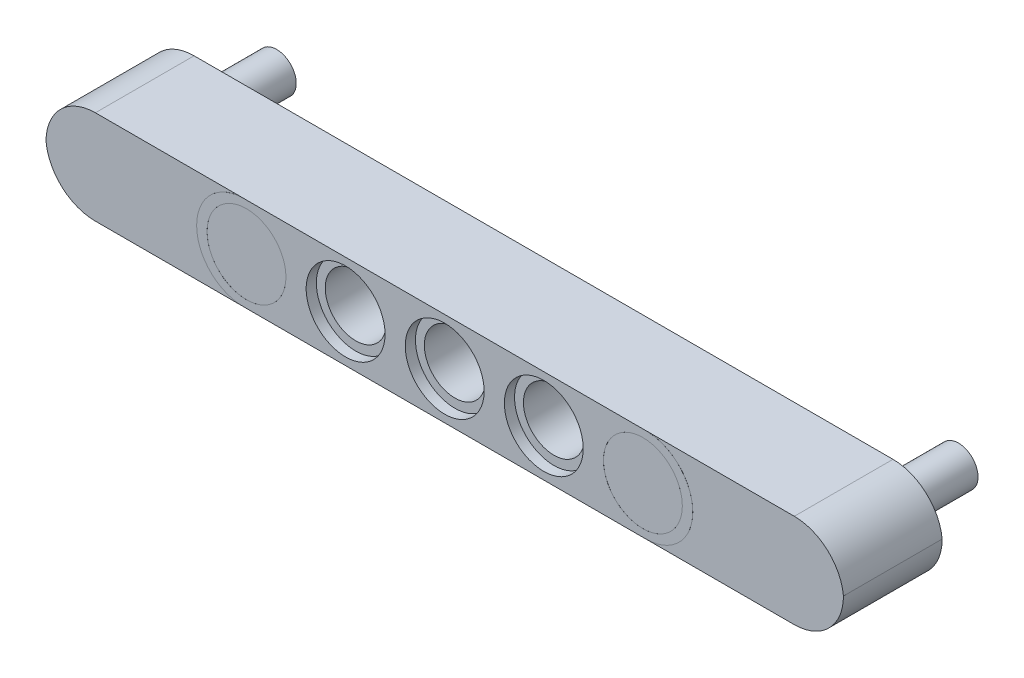
ISO-10303-21;
HEADER;
FILE_DESCRIPTION(('STEP AP214'),'2;1');
FILE_NAME('part.step','',(''),(''),'','','');
FILE_SCHEMA(('AUTOMOTIVE_DESIGN { 1 0 10303 214 1 1 1 1 }'));
ENDSEC;
DATA;
#1=APPLICATION_CONTEXT('core data for automotive mechanical design processes');
#2=APPLICATION_PROTOCOL_DEFINITION('international standard','automotive_design',2000,#1);
#3=PRODUCT_CONTEXT('',#1,'mechanical');
#4=PRODUCT('Part','Part','',(#3));
#5=PRODUCT_RELATED_PRODUCT_CATEGORY('part','',(#4));
#6=PRODUCT_DEFINITION_FORMATION('','',#4);
#7=PRODUCT_DEFINITION_CONTEXT('part definition',#1,'design');
#8=PRODUCT_DEFINITION('design','',#6,#7);
#9=PRODUCT_DEFINITION_SHAPE('','',#8);
#10=(LENGTH_UNIT() NAMED_UNIT(*) SI_UNIT(.MILLI.,.METRE.));
#11=(NAMED_UNIT(*) PLANE_ANGLE_UNIT() SI_UNIT($,.RADIAN.));
#12=(NAMED_UNIT(*) SI_UNIT($,.STERADIAN.) SOLID_ANGLE_UNIT());
#13=UNCERTAINTY_MEASURE_WITH_UNIT(LENGTH_MEASURE(1.E-05),#10,'distance_accuracy_value','');
#14=(GEOMETRIC_REPRESENTATION_CONTEXT(3) GLOBAL_UNCERTAINTY_ASSIGNED_CONTEXT((#13)) GLOBAL_UNIT_ASSIGNED_CONTEXT((#10,
#11,#12)) REPRESENTATION_CONTEXT('',''));
#15=CARTESIAN_POINT('',(0.,0.,0.));
#16=DIRECTION('',(0.,0.,1.));
#17=DIRECTION('',(1.,0.,0.));
#18=AXIS2_PLACEMENT_3D('',#15,#16,#17);
#19=CARTESIAN_POINT('',(35.7843,3.69,7.8764));
#20=DIRECTION('',(0.,0.,1.));
#21=DIRECTION('',(1.,0.,0.));
#22=AXIS2_PLACEMENT_3D('',#19,#20,#21);
#23=CYLINDRICAL_SURFACE('',#22,3.8007);
#24=DIRECTION('',(0.,0.,1.));
#25=VECTOR('',#24,1.);
#26=CARTESIAN_POINT('',(35.7843,-0.1107,7.8764));
#27=LINE('',#26,#25);
#28=CARTESIAN_POINT('',(35.7843,-0.110699999999999,7.8736));
#29=VERTEX_POINT('',#28);
#30=CARTESIAN_POINT('',(35.7843,-0.1107,7.8764));
#31=VERTEX_POINT('',#30);
#32=EDGE_CURVE('E161',#29,#31,#27,.T.);
#33=ORIENTED_EDGE('',*,*,#32,.F.);
#34=CARTESIAN_POINT('',(35.7843,3.69,7.8736));
#35=DIRECTION('',(0.,0.,-1.));
#36=DIRECTION('',(-1.,0.,0.));
#37=AXIS2_PLACEMENT_3D('',#34,#35,#36);
#38=CIRCLE('',#37,3.8007);
#39=CARTESIAN_POINT('',(39.585,3.69,7.8736));
#40=VERTEX_POINT('',#39);
#41=EDGE_CURVE('E227',#29,#40,#38,.F.);
#42=ORIENTED_EDGE('',*,*,#41,.T.);
#43=DIRECTION('',(0.,0.,1.));
#44=VECTOR('',#43,1.);
#45=CARTESIAN_POINT('',(39.585,3.69,7.8764));
#46=LINE('',#45,#44);
#47=CARTESIAN_POINT('',(39.585,3.69,7.8764));
#48=VERTEX_POINT('',#47);
#49=EDGE_CURVE('E149',#40,#48,#46,.T.);
#50=ORIENTED_EDGE('',*,*,#49,.T.);
#51=CARTESIAN_POINT('',(35.7843,3.69,7.8764));
#52=DIRECTION('',(0.,0.,-1.));
#53=DIRECTION('',(-1.,0.,0.));
#54=AXIS2_PLACEMENT_3D('',#51,#52,#53);
#55=CIRCLE('',#54,3.8007);
#56=EDGE_CURVE('E163',#31,#48,#55,.F.);
#57=ORIENTED_EDGE('',*,*,#56,.F.);
#58=EDGE_LOOP('',(#33,#42,#50,#57));
#59=FACE_BOUND('',#58,.T.);
#60=ADVANCED_FACE('F39',(#59),#23,.T.);
#61=CARTESIAN_POINT('',(35.7843,3.69,7.8764));
#62=DIRECTION('',(0.,0.,1.));
#63=DIRECTION('',(1.,0.,0.));
#64=AXIS2_PLACEMENT_3D('',#61,#62,#63);
#65=CYLINDRICAL_SURFACE('',#64,3.8007);
#66=ORIENTED_EDGE('',*,*,#49,.F.);
#67=CARTESIAN_POINT('',(35.7843,3.69,7.8736));
#68=DIRECTION('',(0.,0.,-1.));
#69=DIRECTION('',(-1.,0.,0.));
#70=AXIS2_PLACEMENT_3D('',#67,#68,#69);
#71=CIRCLE('',#70,3.8007);
#72=CARTESIAN_POINT('',(35.7843,7.4907,7.8736));
#73=VERTEX_POINT('',#72);
#74=EDGE_CURVE('E166',#40,#73,#71,.F.);
#75=ORIENTED_EDGE('',*,*,#74,.T.);
#76=DIRECTION('',(0.,0.,1.));
#77=VECTOR('',#76,1.);
#78=CARTESIAN_POINT('',(35.7843,7.4907,7.8764));
#79=LINE('',#78,#77);
#80=CARTESIAN_POINT('',(35.7843,7.4907,7.8764));
#81=VERTEX_POINT('',#80);
#82=EDGE_CURVE('E156',#81,#73,#79,.F.);
#83=ORIENTED_EDGE('',*,*,#82,.F.);
#84=CARTESIAN_POINT('',(35.7843,3.69,7.8764));
#85=DIRECTION('',(0.,0.,-1.));
#86=DIRECTION('',(-1.,0.,0.));
#87=AXIS2_PLACEMENT_3D('',#84,#85,#86);
#88=CIRCLE('',#87,3.8007);
#89=EDGE_CURVE('E159',#48,#81,#88,.F.);
#90=ORIENTED_EDGE('',*,*,#89,.F.);
#91=EDGE_LOOP('',(#66,#75,#83,#90));
#92=FACE_BOUND('',#91,.T.);
#93=ADVANCED_FACE('F359',(#92),#65,.T.);
#94=CARTESIAN_POINT('',(3.4526,3.69,7.8764));
#95=DIRECTION('',(0.,0.,-1.));
#96=DIRECTION('',(-1.,0.,0.));
#97=AXIS2_PLACEMENT_3D('',#94,#95,#96);
#98=CYLINDRICAL_SURFACE('',#97,3.193);
#99=CARTESIAN_POINT('',(3.4526,3.69,7.8764));
#100=DIRECTION('',(0.,0.,1.));
#101=DIRECTION('',(1.,0.,0.));
#102=AXIS2_PLACEMENT_3D('',#99,#100,#101);
#103=CIRCLE('',#102,3.193);
#104=CARTESIAN_POINT('',(6.6456,3.69,7.8764));
#105=VERTEX_POINT('',#104);
#106=EDGE_CURVE('E279',#105,#105,#103,.T.);
#107=ORIENTED_EDGE('',*,*,#106,.T.);
#108=EDGE_LOOP('',(#107));
#109=FACE_BOUND('',#108,.T.);
#110=CARTESIAN_POINT('',(3.4526,3.69,7.8736));
#111=DIRECTION('',(0.,0.,-1.));
#112=DIRECTION('',(-1.,0.,0.));
#113=AXIS2_PLACEMENT_3D('',#110,#111,#112);
#114=CIRCLE('',#113,3.193);
#115=CARTESIAN_POINT('',(0.259599999999998,3.69,7.8736));
#116=VERTEX_POINT('',#115);
#117=EDGE_CURVE('E230',#116,#116,#114,.T.);
#118=ORIENTED_EDGE('',*,*,#117,.T.);
#119=EDGE_LOOP('',(#118));
#120=FACE_BOUND('',#119,.T.);
#121=ADVANCED_FACE('F366',(#109,#120),#98,.F.);
#122=CARTESIAN_POINT('',(35.5474,3.69,7.8764));
#123=DIRECTION('',(0.,0.,-1.));
#124=DIRECTION('',(-1.,0.,0.));
#125=AXIS2_PLACEMENT_3D('',#122,#123,#124);
#126=CYLINDRICAL_SURFACE('',#125,3.193);
#127=CARTESIAN_POINT('',(35.5474,3.69,7.8764));
#128=DIRECTION('',(0.,0.,1.));
#129=DIRECTION('',(1.,0.,0.));
#130=AXIS2_PLACEMENT_3D('',#127,#128,#129);
#131=CIRCLE('',#130,3.193);
#132=CARTESIAN_POINT('',(38.7404,3.69,7.8764));
#133=VERTEX_POINT('',#132);
#134=EDGE_CURVE('E300',#133,#133,#131,.T.);
#135=ORIENTED_EDGE('',*,*,#134,.T.);
#136=EDGE_LOOP('',(#135));
#137=FACE_BOUND('',#136,.T.);
#138=CARTESIAN_POINT('',(35.5474,3.69,7.8736));
#139=DIRECTION('',(0.,0.,-1.));
#140=DIRECTION('',(-1.,0.,0.));
#141=AXIS2_PLACEMENT_3D('',#138,#139,#140);
#142=CIRCLE('',#141,3.193);
#143=CARTESIAN_POINT('',(32.3544,3.69,7.8736));
#144=VERTEX_POINT('',#143);
#145=EDGE_CURVE('E236',#144,#144,#142,.T.);
#146=ORIENTED_EDGE('',*,*,#145,.T.);
#147=EDGE_LOOP('',(#146));
#148=FACE_BOUND('',#147,.T.);
#149=ADVANCED_FACE('F502',(#137,#148),#126,.F.);
#150=CARTESIAN_POINT('',(3.2157,3.69,7.8764));
#151=DIRECTION('',(0.,0.,-1.));
#152=DIRECTION('',(-1.,0.,0.));
#153=AXIS2_PLACEMENT_3D('',#150,#151,#152);
#154=CYLINDRICAL_SURFACE('',#153,3.8007);
#155=CARTESIAN_POINT('',(3.2157,3.69,7.8736));
#156=DIRECTION('',(0.,0.,1.));
#157=DIRECTION('',(1.,0.,0.));
#158=AXIS2_PLACEMENT_3D('',#155,#156,#157);
#159=CIRCLE('',#158,3.8007);
#160=CARTESIAN_POINT('',(3.21569999999996,-0.1107,7.8736));
#161=VERTEX_POINT('',#160);
#162=CARTESIAN_POINT('',(-0.584999999999999,3.69,7.8736));
#163=VERTEX_POINT('',#162);
#164=EDGE_CURVE('E127',#161,#163,#159,.F.);
#165=ORIENTED_EDGE('',*,*,#164,.F.);
#166=DIRECTION('',(0.,0.,-1.));
#167=VECTOR('',#166,1.);
#168=CARTESIAN_POINT('',(3.2157,-0.1107,7.8764));
#169=LINE('',#168,#167);
#170=CARTESIAN_POINT('',(3.2157,-0.1107,7.8764));
#171=VERTEX_POINT('',#170);
#172=EDGE_CURVE('E137',#171,#161,#169,.T.);
#173=ORIENTED_EDGE('',*,*,#172,.F.);
#174=CARTESIAN_POINT('',(3.2157,3.69,7.8764));
#175=DIRECTION('',(0.,0.,-1.));
#176=DIRECTION('',(-1.,0.,0.));
#177=AXIS2_PLACEMENT_3D('',#174,#175,#176);
#178=CIRCLE('',#177,3.8007);
#179=CARTESIAN_POINT('',(-0.584999999999999,3.69,7.8764));
#180=VERTEX_POINT('',#179);
#181=EDGE_CURVE('E146',#180,#171,#178,.F.);
#182=ORIENTED_EDGE('',*,*,#181,.F.);
#183=DIRECTION('',(0.,0.,1.));
#184=VECTOR('',#183,1.);
#185=CARTESIAN_POINT('',(-0.584999999999999,3.69,7.8764));
#186=LINE('',#185,#184);
#187=EDGE_CURVE('E140',#180,#163,#186,.F.);
#188=ORIENTED_EDGE('',*,*,#187,.T.);
#189=EDGE_LOOP('',(#165,#173,#182,#188));
#190=FACE_BOUND('',#189,.T.);
#191=ADVANCED_FACE('F136',(#190),#154,.T.);
#192=CARTESIAN_POINT('',(3.2157,3.69,7.8764));
#193=DIRECTION('',(0.,0.,1.));
#194=DIRECTION('',(1.,0.,0.));
#195=AXIS2_PLACEMENT_3D('',#192,#193,#194);
#196=CYLINDRICAL_SURFACE('',#195,3.8007);
#197=CARTESIAN_POINT('',(3.2157,3.69,7.8736));
#198=DIRECTION('',(0.,0.,1.));
#199=DIRECTION('',(1.,0.,0.));
#200=AXIS2_PLACEMENT_3D('',#197,#198,#199);
#201=CIRCLE('',#200,3.8007);
#202=CARTESIAN_POINT('',(3.2157,7.4907,7.8736));
#203=VERTEX_POINT('',#202);
#204=EDGE_CURVE('E169',#163,#203,#201,.F.);
#205=ORIENTED_EDGE('',*,*,#204,.F.);
#206=ORIENTED_EDGE('',*,*,#187,.F.);
#207=CARTESIAN_POINT('',(3.2157,3.69,7.8764));
#208=DIRECTION('',(0.,0.,-1.));
#209=DIRECTION('',(-1.,0.,0.));
#210=AXIS2_PLACEMENT_3D('',#207,#208,#209);
#211=CIRCLE('',#210,3.8007);
#212=CARTESIAN_POINT('',(3.2157,7.4907,7.8764));
#213=VERTEX_POINT('',#212);
#214=EDGE_CURVE('E147',#213,#180,#211,.F.);
#215=ORIENTED_EDGE('',*,*,#214,.F.);
#216=DIRECTION('',(0.,0.,1.));
#217=VECTOR('',#216,1.);
#218=CARTESIAN_POINT('',(3.2157,7.4907,7.8764));
#219=LINE('',#218,#217);
#220=EDGE_CURVE('E303',#203,#213,#219,.T.);
#221=ORIENTED_EDGE('',*,*,#220,.F.);
#222=EDGE_LOOP('',(#205,#206,#215,#221));
#223=FACE_BOUND('',#222,.T.);
#224=ADVANCED_FACE('F315',(#223),#196,.T.);
#225=CARTESIAN_POINT('',(27.5237,3.69,-0.1164));
#226=DIRECTION('',(0.,0.,1.));
#227=DIRECTION('',(1.,0.,0.));
#228=AXIS2_PLACEMENT_3D('',#225,#226,#227);
#229=CYLINDRICAL_SURFACE('',#228,3.193);
#230=CARTESIAN_POINT('',(27.5237,3.69,-0.1164));
#231=DIRECTION('',(0.,0.,1.));
#232=DIRECTION('',(1.,0.,0.));
#233=AXIS2_PLACEMENT_3D('',#230,#231,#232);
#234=CIRCLE('',#233,3.193);
#235=CARTESIAN_POINT('',(30.7167,3.69,-0.1164));
#236=VERTEX_POINT('',#235);
#237=EDGE_CURVE('E297',#236,#236,#234,.T.);
#238=ORIENTED_EDGE('',*,*,#237,.F.);
#239=EDGE_LOOP('',(#238));
#240=FACE_BOUND('',#239,.T.);
#241=CARTESIAN_POINT('',(27.5237,3.69,0.7076));
#242=DIRECTION('',(0.,0.,1.));
#243=DIRECTION('',(1.,0.,0.));
#244=AXIS2_PLACEMENT_3D('',#241,#242,#243);
#245=CIRCLE('',#244,3.193);
#246=CARTESIAN_POINT('',(30.7167,3.69,0.7076));
#247=VERTEX_POINT('',#246);
#248=EDGE_CURVE('E294',#247,#247,#245,.T.);
#249=ORIENTED_EDGE('',*,*,#248,.T.);
#250=EDGE_LOOP('',(#249));
#251=FACE_BOUND('',#250,.T.);
#252=ADVANCED_FACE('F493',(#240,#251),#229,.F.);
#253=CARTESIAN_POINT('',(7.4387,-0.1107,0.7076));
#254=DIRECTION('',(0.,0.,1.));
#255=DIRECTION('',(1.,0.,0.));
#256=AXIS2_PLACEMENT_3D('',#253,#254,#255);
#257=PLANE('',#256);
#258=ORIENTED_EDGE('',*,*,#248,.F.);
#259=EDGE_LOOP('',(#258));
#260=FACE_BOUND('',#259,.T.);
#261=CARTESIAN_POINT('',(27.5237,3.69,0.7076));
#262=DIRECTION('',(0.,0.,1.));
#263=DIRECTION('',(1.,0.,0.));
#264=AXIS2_PLACEMENT_3D('',#261,#262,#263);
#265=CIRCLE('',#264,2.472);
#266=CARTESIAN_POINT('',(29.9957,3.69,0.7076));
#267=VERTEX_POINT('',#266);
#268=EDGE_CURVE('E285',#267,#267,#265,.F.);
#269=ORIENTED_EDGE('',*,*,#268,.F.);
#270=EDGE_LOOP('',(#269));
#271=FACE_BOUND('',#270,.T.);
#272=ADVANCED_FACE('F667',(#260,#271),#257,.F.);
#273=CARTESIAN_POINT('',(7.4387,-0.1107,7.05239999999999));
#274=DIRECTION('',(0.,0.,-1.));
#275=DIRECTION('',(-1.,0.,0.));
#276=AXIS2_PLACEMENT_3D('',#273,#274,#275);
#277=PLANE('',#276);
#278=CARTESIAN_POINT('',(27.5237,3.69,7.0524));
#279=DIRECTION('',(0.,0.,1.));
#280=DIRECTION('',(1.,0.,0.));
#281=AXIS2_PLACEMENT_3D('',#278,#279,#280);
#282=CIRCLE('',#281,3.193);
#283=CARTESIAN_POINT('',(30.7167,3.69,7.0524));
#284=VERTEX_POINT('',#283);
#285=EDGE_CURVE('E291',#284,#284,#282,.T.);
#286=ORIENTED_EDGE('',*,*,#285,.T.);
#287=EDGE_LOOP('',(#286));
#288=FACE_BOUND('',#287,.T.);
#289=CARTESIAN_POINT('',(27.5237,3.69,7.05239999999999));
#290=DIRECTION('',(0.,0.,-1.));
#291=DIRECTION('',(-1.,0.,0.));
#292=AXIS2_PLACEMENT_3D('',#289,#290,#291);
#293=CIRCLE('',#292,2.472);
#294=CARTESIAN_POINT('',(25.0517,3.69,7.05239999999999));
#295=VERTEX_POINT('',#294);
#296=EDGE_CURVE('E282',#295,#295,#293,.F.);
#297=ORIENTED_EDGE('',*,*,#296,.F.);
#298=EDGE_LOOP('',(#297));
#299=FACE_BOUND('',#298,.T.);
#300=ADVANCED_FACE('F663',(#288,#299),#277,.F.);
#301=CARTESIAN_POINT('',(27.5237,3.69,7.8764));
#302=DIRECTION('',(0.,0.,-1.));
#303=DIRECTION('',(-1.,0.,0.));
#304=AXIS2_PLACEMENT_3D('',#301,#302,#303);
#305=CYLINDRICAL_SURFACE('',#304,3.193);
#306=CARTESIAN_POINT('',(27.5237,3.69,7.8764));
#307=DIRECTION('',(0.,0.,1.));
#308=DIRECTION('',(1.,0.,0.));
#309=AXIS2_PLACEMENT_3D('',#306,#307,#308);
#310=CIRCLE('',#309,3.193);
#311=CARTESIAN_POINT('',(30.7167,3.69,7.8764));
#312=VERTEX_POINT('',#311);
#313=EDGE_CURVE('E288',#312,#312,#310,.T.);
#314=ORIENTED_EDGE('',*,*,#313,.T.);
#315=EDGE_LOOP('',(#314));
#316=FACE_BOUND('',#315,.T.);
#317=ORIENTED_EDGE('',*,*,#285,.F.);
#318=EDGE_LOOP('',(#317));
#319=FACE_BOUND('',#318,.T.);
#320=ADVANCED_FACE('F659',(#316,#319),#305,.F.);
#321=CARTESIAN_POINT('',(27.5237,3.69,-0.1164));
#322=DIRECTION('',(0.,0.,1.));
#323=DIRECTION('',(1.,0.,0.));
#324=AXIS2_PLACEMENT_3D('',#321,#322,#323);
#325=CYLINDRICAL_SURFACE('',#324,2.472);
#326=ORIENTED_EDGE('',*,*,#296,.T.);
#327=EDGE_LOOP('',(#326));
#328=FACE_BOUND('',#327,.T.);
#329=ORIENTED_EDGE('',*,*,#268,.T.);
#330=EDGE_LOOP('',(#329));
#331=FACE_BOUND('',#330,.T.);
#332=ADVANCED_FACE('F610',(#328,#331),#325,.F.);
#333=CARTESIAN_POINT('',(11.4763,3.69,7.8764));
#334=DIRECTION('',(0.,0.,-1.));
#335=DIRECTION('',(-1.,0.,0.));
#336=AXIS2_PLACEMENT_3D('',#333,#334,#335);
#337=CYLINDRICAL_SURFACE('',#336,3.193);
#338=CARTESIAN_POINT('',(11.4763,3.69,7.8764));
#339=DIRECTION('',(0.,0.,1.));
#340=DIRECTION('',(1.,0.,0.));
#341=AXIS2_PLACEMENT_3D('',#338,#339,#340);
#342=CIRCLE('',#341,3.193);
#343=CARTESIAN_POINT('',(14.6693,3.69,7.8764));
#344=VERTEX_POINT('',#343);
#345=EDGE_CURVE('E276',#344,#344,#342,.T.);
#346=ORIENTED_EDGE('',*,*,#345,.T.);
#347=EDGE_LOOP('',(#346));
#348=FACE_BOUND('',#347,.T.);
#349=CARTESIAN_POINT('',(11.4763,3.69,7.0524));
#350=DIRECTION('',(0.,0.,1.));
#351=DIRECTION('',(1.,0.,0.));
#352=AXIS2_PLACEMENT_3D('',#349,#350,#351);
#353=CIRCLE('',#352,3.193);
#354=CARTESIAN_POINT('',(14.6693,3.69,7.0524));
#355=VERTEX_POINT('',#354);
#356=EDGE_CURVE('E267',#355,#355,#353,.T.);
#357=ORIENTED_EDGE('',*,*,#356,.F.);
#358=EDGE_LOOP('',(#357));
#359=FACE_BOUND('',#358,.T.);
#360=ADVANCED_FACE('F603',(#348,#359),#337,.F.);
#361=CARTESIAN_POINT('',(-8.6087,-0.1107,0.7076));
#362=DIRECTION('',(0.,0.,1.));
#363=DIRECTION('',(1.,0.,0.));
#364=AXIS2_PLACEMENT_3D('',#361,#362,#363);
#365=PLANE('',#364);
#366=CARTESIAN_POINT('',(11.4763,3.69,0.7076));
#367=DIRECTION('',(0.,0.,1.));
#368=DIRECTION('',(1.,0.,0.));
#369=AXIS2_PLACEMENT_3D('',#366,#367,#368);
#370=CIRCLE('',#369,3.193);
#371=CARTESIAN_POINT('',(14.6693,3.69,0.7076));
#372=VERTEX_POINT('',#371);
#373=EDGE_CURVE('E273',#372,#372,#370,.T.);
#374=ORIENTED_EDGE('',*,*,#373,.F.);
#375=EDGE_LOOP('',(#374));
#376=FACE_BOUND('',#375,.T.);
#377=CARTESIAN_POINT('',(11.4763,3.69,0.7076));
#378=DIRECTION('',(0.,0.,1.));
#379=DIRECTION('',(1.,0.,0.));
#380=AXIS2_PLACEMENT_3D('',#377,#378,#379);
#381=CIRCLE('',#380,2.472);
#382=CARTESIAN_POINT('',(13.9483,3.69,0.7076));
#383=VERTEX_POINT('',#382);
#384=EDGE_CURVE('E264',#383,#383,#381,.F.);
#385=ORIENTED_EDGE('',*,*,#384,.F.);
#386=EDGE_LOOP('',(#385));
#387=FACE_BOUND('',#386,.T.);
#388=ADVANCED_FACE('F609',(#376,#387),#365,.F.);
#389=CARTESIAN_POINT('',(11.4763,3.69,-0.1164));
#390=DIRECTION('',(0.,0.,1.));
#391=DIRECTION('',(1.,0.,0.));
#392=AXIS2_PLACEMENT_3D('',#389,#390,#391);
#393=CYLINDRICAL_SURFACE('',#392,3.193);
#394=CARTESIAN_POINT('',(11.4763,3.69,-0.1164));
#395=DIRECTION('',(0.,0.,1.));
#396=DIRECTION('',(1.,0.,0.));
#397=AXIS2_PLACEMENT_3D('',#394,#395,#396);
#398=CIRCLE('',#397,3.193);
#399=CARTESIAN_POINT('',(14.6693,3.69,-0.1164));
#400=VERTEX_POINT('',#399);
#401=EDGE_CURVE('E270',#400,#400,#398,.T.);
#402=ORIENTED_EDGE('',*,*,#401,.F.);
#403=EDGE_LOOP('',(#402));
#404=FACE_BOUND('',#403,.T.);
#405=ORIENTED_EDGE('',*,*,#373,.T.);
#406=EDGE_LOOP('',(#405));
#407=FACE_BOUND('',#406,.T.);
#408=ADVANCED_FACE('F622',(#404,#407),#393,.F.);
#409=CARTESIAN_POINT('',(-8.6087,-0.1107,7.05239999999999));
#410=DIRECTION('',(0.,0.,-1.));
#411=DIRECTION('',(-1.,0.,0.));
#412=AXIS2_PLACEMENT_3D('',#409,#410,#411);
#413=PLANE('',#412);
#414=ORIENTED_EDGE('',*,*,#356,.T.);
#415=EDGE_LOOP('',(#414));
#416=FACE_BOUND('',#415,.T.);
#417=CARTESIAN_POINT('',(11.4763,3.69,7.05239999999999));
#418=DIRECTION('',(0.,0.,-1.));
#419=DIRECTION('',(-1.,0.,0.));
#420=AXIS2_PLACEMENT_3D('',#417,#418,#419);
#421=CIRCLE('',#420,2.472);
#422=CARTESIAN_POINT('',(9.0043,3.69,7.05239999999999));
#423=VERTEX_POINT('',#422);
#424=EDGE_CURVE('E255',#423,#423,#421,.F.);
#425=ORIENTED_EDGE('',*,*,#424,.F.);
#426=EDGE_LOOP('',(#425));
#427=FACE_BOUND('',#426,.T.);
#428=ADVANCED_FACE('F632',(#416,#427),#413,.F.);
#429=CARTESIAN_POINT('',(11.4763,3.69,-0.1164));
#430=DIRECTION('',(0.,0.,1.));
#431=DIRECTION('',(1.,0.,0.));
#432=AXIS2_PLACEMENT_3D('',#429,#430,#431);
#433=CYLINDRICAL_SURFACE('',#432,2.472);
#434=ORIENTED_EDGE('',*,*,#424,.T.);
#435=EDGE_LOOP('',(#434));
#436=FACE_BOUND('',#435,.T.);
#437=ORIENTED_EDGE('',*,*,#384,.T.);
#438=EDGE_LOOP('',(#437));
#439=FACE_BOUND('',#438,.T.);
#440=ADVANCED_FACE('F414',(#436,#439),#433,.F.);
#441=CARTESIAN_POINT('',(-0.584999999999999,-0.1107,7.8764));
#442=DIRECTION('',(0.,1.,0.));
#443=DIRECTION('',(0.,0.,1.));
#444=AXIS2_PLACEMENT_3D('',#441,#442,#443);
#445=PLANE('',#444);
#446=DIRECTION('',(-1.,0.,0.));
#447=VECTOR('',#446,1.);
#448=CARTESIAN_POINT('',(3.21569999999996,-0.1107,7.8736));
#449=LINE('',#448,#447);
#450=CARTESIAN_POINT('',(-8.80420979499208,-0.1107,7.8736));
#451=VERTEX_POINT('',#450);
#452=EDGE_CURVE('E123',#161,#451,#449,.T.);
#453=ORIENTED_EDGE('',*,*,#452,.T.);
#454=DIRECTION('',(0.,0.,-1.));
#455=VECTOR('',#454,1.);
#456=CARTESIAN_POINT('',(-8.80420979499208,-0.1107,7.8764));
#457=LINE('',#456,#455);
#458=CARTESIAN_POINT('',(-8.80420979499208,-0.1107,-0.116400000000001));
#459=VERTEX_POINT('',#458);
#460=EDGE_CURVE('E196',#451,#459,#457,.T.);
#461=ORIENTED_EDGE('',*,*,#460,.T.);
#462=DIRECTION('',(1.,0.,0.));
#463=VECTOR('',#462,1.);
#464=CARTESIAN_POINT('',(-0.584999999999999,-0.1107,-0.1164));
#465=LINE('',#464,#463);
#466=CARTESIAN_POINT('',(47.7843,-0.1107,-0.1164));
#467=VERTEX_POINT('',#466);
#468=EDGE_CURVE('E204',#459,#467,#465,.T.);
#469=ORIENTED_EDGE('',*,*,#468,.T.);
#470=DIRECTION('',(0.,0.,-1.));
#471=VECTOR('',#470,1.);
#472=CARTESIAN_POINT('',(47.7843,-0.1107,7.8736));
#473=LINE('',#472,#471);
#474=CARTESIAN_POINT('',(47.7843,-0.110700000000001,7.8736));
#475=VERTEX_POINT('',#474);
#476=EDGE_CURVE('E177',#467,#475,#473,.F.);
#477=ORIENTED_EDGE('',*,*,#476,.T.);
#478=DIRECTION('',(-1.,0.,0.));
#479=VECTOR('',#478,1.);
#480=CARTESIAN_POINT('',(35.7843,-0.110699999999999,7.8736));
#481=LINE('',#480,#479);
#482=EDGE_CURVE('E225',#475,#29,#481,.T.);
#483=ORIENTED_EDGE('',*,*,#482,.T.);
#484=ORIENTED_EDGE('',*,*,#32,.T.);
#485=DIRECTION('',(1.,0.,0.));
#486=VECTOR('',#485,1.);
#487=CARTESIAN_POINT('',(-0.584999999999999,-0.1107,7.8764));
#488=LINE('',#487,#486);
#489=EDGE_CURVE('E145',#171,#31,#488,.T.);
#490=ORIENTED_EDGE('',*,*,#489,.F.);
#491=ORIENTED_EDGE('',*,*,#172,.T.);
#492=EDGE_LOOP('',(#453,#461,#469,#477,#483,#484,#490,#491));
#493=FACE_BOUND('',#492,.T.);
#494=ADVANCED_FACE('F143',(#493),#445,.F.);
#495=CARTESIAN_POINT('',(-0.584999999999999,7.4907,7.8764));
#496=DIRECTION('',(0.,-1.,0.));
#497=DIRECTION('',(0.,0.,-1.));
#498=AXIS2_PLACEMENT_3D('',#495,#496,#497);
#499=PLANE('',#498);
#500=DIRECTION('',(-1.,0.,0.));
#501=VECTOR('',#500,1.);
#502=CARTESIAN_POINT('',(-0.584999999999999,7.4907,-0.1164));
#503=LINE('',#502,#501);
#504=CARTESIAN_POINT('',(47.8042097949921,7.4907,-0.116400000000001));
#505=VERTEX_POINT('',#504);
#506=CARTESIAN_POINT('',(-8.7843,7.4907,-0.1164));
#507=VERTEX_POINT('',#506);
#508=EDGE_CURVE('E212',#505,#507,#503,.T.);
#509=ORIENTED_EDGE('',*,*,#508,.T.);
#510=DIRECTION('',(0.,0.,-1.));
#511=VECTOR('',#510,1.);
#512=CARTESIAN_POINT('',(-8.7843,7.4907,7.8736));
#513=LINE('',#512,#511);
#514=CARTESIAN_POINT('',(-8.7843,7.4907,7.8736));
#515=VERTEX_POINT('',#514);
#516=EDGE_CURVE('E192',#507,#515,#513,.F.);
#517=ORIENTED_EDGE('',*,*,#516,.T.);
#518=DIRECTION('',(1.,0.,0.));
#519=VECTOR('',#518,1.);
#520=CARTESIAN_POINT('',(3.21569999999996,7.4907,7.8736));
#521=LINE('',#520,#519);
#522=EDGE_CURVE('E131',#515,#203,#521,.T.);
#523=ORIENTED_EDGE('',*,*,#522,.T.);
#524=ORIENTED_EDGE('',*,*,#220,.T.);
#525=DIRECTION('',(-1.,0.,0.));
#526=VECTOR('',#525,1.);
#527=CARTESIAN_POINT('',(-0.584999999999999,7.4907,7.8764));
#528=LINE('',#527,#526);
#529=EDGE_CURVE('E253',#81,#213,#528,.T.);
#530=ORIENTED_EDGE('',*,*,#529,.F.);
#531=ORIENTED_EDGE('',*,*,#82,.T.);
#532=DIRECTION('',(1.,0.,0.));
#533=VECTOR('',#532,1.);
#534=CARTESIAN_POINT('',(35.7843,7.4907,7.8736));
#535=LINE('',#534,#533);
#536=CARTESIAN_POINT('',(47.8042097949921,7.4907,7.8736));
#537=VERTEX_POINT('',#536);
#538=EDGE_CURVE('E141',#73,#537,#535,.T.);
#539=ORIENTED_EDGE('',*,*,#538,.T.);
#540=DIRECTION('',(0.,0.,-1.));
#541=VECTOR('',#540,1.);
#542=CARTESIAN_POINT('',(47.8042097949921,7.4907,7.8764));
#543=LINE('',#542,#541);
#544=EDGE_CURVE('E181',#537,#505,#543,.T.);
#545=ORIENTED_EDGE('',*,*,#544,.T.);
#546=EDGE_LOOP('',(#509,#517,#523,#524,#530,#531,#539,#545));
#547=FACE_BOUND('',#546,.T.);
#548=ADVANCED_FACE('F307',(#547),#499,.F.);
#549=CARTESIAN_POINT('',(-0.584999999999999,-0.1107,7.8764));
#550=DIRECTION('',(0.,0.,-1.));
#551=DIRECTION('',(-1.,0.,0.));
#552=AXIS2_PLACEMENT_3D('',#549,#550,#551);
#553=PLANE('',#552);
#554=ORIENTED_EDGE('',*,*,#134,.F.);
#555=EDGE_LOOP('',(#554));
#556=FACE_BOUND('',#555,.T.);
#557=ORIENTED_EDGE('',*,*,#313,.F.);
#558=EDGE_LOOP('',(#557));
#559=FACE_BOUND('',#558,.T.);
#560=ORIENTED_EDGE('',*,*,#106,.F.);
#561=EDGE_LOOP('',(#560));
#562=FACE_BOUND('',#561,.T.);
#563=ORIENTED_EDGE('',*,*,#345,.F.);
#564=EDGE_LOOP('',(#563));
#565=FACE_BOUND('',#564,.T.);
#566=CARTESIAN_POINT('',(19.5,3.69,7.8764));
#567=DIRECTION('',(0.,0.,1.));
#568=DIRECTION('',(1.,0.,0.));
#569=AXIS2_PLACEMENT_3D('',#566,#567,#568);
#570=CIRCLE('',#569,3.193);
#571=CARTESIAN_POINT('',(22.693,3.69,7.8764));
#572=VERTEX_POINT('',#571);
#573=EDGE_CURVE('E239',#572,#572,#570,.T.);
#574=ORIENTED_EDGE('',*,*,#573,.F.);
#575=EDGE_LOOP('',(#574));
#576=FACE_BOUND('',#575,.T.);
#577=ORIENTED_EDGE('',*,*,#489,.T.);
#578=ORIENTED_EDGE('',*,*,#56,.T.);
#579=ORIENTED_EDGE('',*,*,#89,.T.);
#580=ORIENTED_EDGE('',*,*,#529,.T.);
#581=ORIENTED_EDGE('',*,*,#214,.T.);
#582=ORIENTED_EDGE('',*,*,#181,.T.);
#583=EDGE_LOOP('',(#577,#578,#579,#580,#581,#582));
#584=FACE_BOUND('',#583,.T.);
#585=ADVANCED_FACE('F312',(#556,#559,#562,#565,#576,#584),#553,.F.);
#586=CARTESIAN_POINT('',(-0.584999999999999,-0.1107,-0.1164));
#587=DIRECTION('',(0.,0.,-1.));
#588=DIRECTION('',(-1.,0.,0.));
#589=AXIS2_PLACEMENT_3D('',#586,#587,#588);
#590=PLANE('',#589);
#591=CARTESIAN_POINT('',(-8.1,3.69,-0.1164));
#592=DIRECTION('',(0.,0.,-1.));
#593=DIRECTION('',(-1.,0.,0.));
#594=AXIS2_PLACEMENT_3D('',#591,#592,#593);
#595=CIRCLE('',#594,1.59);
#596=CARTESIAN_POINT('',(-9.69,3.69,-0.1164));
#597=VERTEX_POINT('',#596);
#598=EDGE_CURVE('E325',#597,#597,#595,.T.);
#599=ORIENTED_EDGE('',*,*,#598,.F.);
#600=EDGE_LOOP('',(#599));
#601=FACE_BOUND('',#600,.T.);
#602=CARTESIAN_POINT('',(47.1,3.69,-0.1164));
#603=DIRECTION('',(0.,0.,-1.));
#604=DIRECTION('',(-1.,0.,0.));
#605=AXIS2_PLACEMENT_3D('',#602,#603,#604);
#606=CIRCLE('',#605,1.59);
#607=CARTESIAN_POINT('',(45.51,3.69,-0.1164));
#608=VERTEX_POINT('',#607);
#609=EDGE_CURVE('E319',#608,#608,#606,.T.);
#610=ORIENTED_EDGE('',*,*,#609,.F.);
#611=EDGE_LOOP('',(#610));
#612=FACE_BOUND('',#611,.T.);
#613=ORIENTED_EDGE('',*,*,#468,.F.);
#614=CARTESIAN_POINT('',(-8.80420979499208,3.8893,-0.116400000000001));
#615=DIRECTION('',(0.,0.,-1.));
#616=DIRECTION('',(-1.,0.,0.));
#617=AXIS2_PLACEMENT_3D('',#614,#615,#616);
#618=CIRCLE('',#617,4.);
#619=CARTESIAN_POINT('',(-12.7843,3.4907,-0.1164));
#620=VERTEX_POINT('',#619);
#621=EDGE_CURVE('E47',#459,#620,#618,.T.);
#622=ORIENTED_EDGE('',*,*,#621,.T.);
#623=CARTESIAN_POINT('',(-8.7843,3.4907,-0.116400000000001));
#624=DIRECTION('',(0.,0.,-1.));
#625=DIRECTION('',(-1.,0.,0.));
#626=AXIS2_PLACEMENT_3D('',#623,#624,#625);
#627=CIRCLE('',#626,4.);
#628=EDGE_CURVE('E190',#620,#507,#627,.T.);
#629=ORIENTED_EDGE('',*,*,#628,.T.);
#630=ORIENTED_EDGE('',*,*,#508,.F.);
#631=CARTESIAN_POINT('',(47.8042097949921,3.4907,-0.116400000000001));
#632=DIRECTION('',(0.,0.,-1.));
#633=DIRECTION('',(-1.,0.,0.));
#634=AXIS2_PLACEMENT_3D('',#631,#632,#633);
#635=CIRCLE('',#634,4.);
#636=CARTESIAN_POINT('',(51.7843,3.8893,-0.1164));
#637=VERTEX_POINT('',#636);
#638=EDGE_CURVE('E184',#505,#637,#635,.T.);
#639=ORIENTED_EDGE('',*,*,#638,.T.);
#640=CARTESIAN_POINT('',(47.7843,3.8893,-0.116400000000001));
#641=DIRECTION('',(0.,0.,-1.));
#642=DIRECTION('',(-1.,0.,0.));
#643=AXIS2_PLACEMENT_3D('',#640,#641,#642);
#644=CIRCLE('',#643,4.);
#645=EDGE_CURVE('E174',#637,#467,#644,.T.);
#646=ORIENTED_EDGE('',*,*,#645,.T.);
#647=EDGE_LOOP('',(#613,#622,#629,#630,#639,#646));
#648=FACE_BOUND('',#647,.T.);
#649=ORIENTED_EDGE('',*,*,#237,.T.);
#650=EDGE_LOOP('',(#649));
#651=FACE_BOUND('',#650,.T.);
#652=ORIENTED_EDGE('',*,*,#401,.T.);
#653=EDGE_LOOP('',(#652));
#654=FACE_BOUND('',#653,.T.);
#655=CARTESIAN_POINT('',(19.5,3.69,-0.1164));
#656=DIRECTION('',(0.,0.,1.));
#657=DIRECTION('',(1.,0.,0.));
#658=AXIS2_PLACEMENT_3D('',#655,#656,#657);
#659=CIRCLE('',#658,3.193);
#660=CARTESIAN_POINT('',(22.693,3.69,-0.1164));
#661=VERTEX_POINT('',#660);
#662=EDGE_CURVE('E246',#661,#661,#659,.T.);
#663=ORIENTED_EDGE('',*,*,#662,.T.);
#664=EDGE_LOOP('',(#663));
#665=FACE_BOUND('',#664,.T.);
#666=ADVANCED_FACE('F200',(#601,#612,#648,#651,#654,#665),#590,.T.);
#667=CARTESIAN_POINT('',(19.5,3.69,-0.1164));
#668=DIRECTION('',(0.,0.,1.));
#669=DIRECTION('',(1.,0.,0.));
#670=AXIS2_PLACEMENT_3D('',#667,#668,#669);
#671=CYLINDRICAL_SURFACE('',#670,2.472);
#672=CARTESIAN_POINT('',(19.5,3.69,7.05239999999999));
#673=DIRECTION('',(0.,0.,-1.));
#674=DIRECTION('',(-1.,0.,0.));
#675=AXIS2_PLACEMENT_3D('',#672,#673,#674);
#676=CIRCLE('',#675,2.472);
#677=CARTESIAN_POINT('',(17.028,3.69,7.05239999999999));
#678=VERTEX_POINT('',#677);
#679=EDGE_CURVE('E245',#678,#678,#676,.F.);
#680=ORIENTED_EDGE('',*,*,#679,.T.);
#681=EDGE_LOOP('',(#680));
#682=FACE_BOUND('',#681,.T.);
#683=CARTESIAN_POINT('',(19.5,3.69,0.7076));
#684=DIRECTION('',(0.,0.,1.));
#685=DIRECTION('',(1.,0.,0.));
#686=AXIS2_PLACEMENT_3D('',#683,#684,#685);
#687=CIRCLE('',#686,2.472);
#688=CARTESIAN_POINT('',(21.972,3.69,0.7076));
#689=VERTEX_POINT('',#688);
#690=EDGE_CURVE('E213',#689,#689,#687,.F.);
#691=ORIENTED_EDGE('',*,*,#690,.T.);
#692=EDGE_LOOP('',(#691));
#693=FACE_BOUND('',#692,.T.);
#694=ADVANCED_FACE('F342',(#682,#693),#671,.F.);
#695=CARTESIAN_POINT('',(-0.584999999999999,-0.1107,0.7076));
#696=DIRECTION('',(0.,0.,1.));
#697=DIRECTION('',(1.,0.,0.));
#698=AXIS2_PLACEMENT_3D('',#695,#696,#697);
#699=PLANE('',#698);
#700=CARTESIAN_POINT('',(19.5,3.69,0.7076));
#701=DIRECTION('',(0.,0.,1.));
#702=DIRECTION('',(1.,0.,0.));
#703=AXIS2_PLACEMENT_3D('',#700,#701,#702);
#704=CIRCLE('',#703,3.193);
#705=CARTESIAN_POINT('',(22.693,3.69,0.7076));
#706=VERTEX_POINT('',#705);
#707=EDGE_CURVE('E249',#706,#706,#704,.T.);
#708=ORIENTED_EDGE('',*,*,#707,.F.);
#709=EDGE_LOOP('',(#708));
#710=FACE_BOUND('',#709,.T.);
#711=ORIENTED_EDGE('',*,*,#690,.F.);
#712=EDGE_LOOP('',(#711));
#713=FACE_BOUND('',#712,.T.);
#714=ADVANCED_FACE('F562',(#710,#713),#699,.F.);
#715=CARTESIAN_POINT('',(19.5,3.69,-0.1164));
#716=DIRECTION('',(0.,0.,1.));
#717=DIRECTION('',(1.,0.,0.));
#718=AXIS2_PLACEMENT_3D('',#715,#716,#717);
#719=CYLINDRICAL_SURFACE('',#718,3.193);
#720=ORIENTED_EDGE('',*,*,#662,.F.);
#721=EDGE_LOOP('',(#720));
#722=FACE_BOUND('',#721,.T.);
#723=ORIENTED_EDGE('',*,*,#707,.T.);
#724=EDGE_LOOP('',(#723));
#725=FACE_BOUND('',#724,.T.);
#726=ADVANCED_FACE('F572',(#722,#725),#719,.F.);
#727=CARTESIAN_POINT('',(-0.584999999999999,-0.1107,7.05239999999999));
#728=DIRECTION('',(0.,0.,-1.));
#729=DIRECTION('',(-1.,0.,0.));
#730=AXIS2_PLACEMENT_3D('',#727,#728,#729);
#731=PLANE('',#730);
#732=CARTESIAN_POINT('',(19.5,3.69,7.0524));
#733=DIRECTION('',(0.,0.,1.));
#734=DIRECTION('',(1.,0.,0.));
#735=AXIS2_PLACEMENT_3D('',#732,#733,#734);
#736=CIRCLE('',#735,3.193);
#737=CARTESIAN_POINT('',(22.693,3.69,7.0524));
#738=VERTEX_POINT('',#737);
#739=EDGE_CURVE('E242',#738,#738,#736,.T.);
#740=ORIENTED_EDGE('',*,*,#739,.T.);
#741=EDGE_LOOP('',(#740));
#742=FACE_BOUND('',#741,.T.);
#743=ORIENTED_EDGE('',*,*,#679,.F.);
#744=EDGE_LOOP('',(#743));
#745=FACE_BOUND('',#744,.T.);
#746=ADVANCED_FACE('F582',(#742,#745),#731,.F.);
#747=CARTESIAN_POINT('',(19.5,3.69,7.8764));
#748=DIRECTION('',(0.,0.,-1.));
#749=DIRECTION('',(-1.,0.,0.));
#750=AXIS2_PLACEMENT_3D('',#747,#748,#749);
#751=CYLINDRICAL_SURFACE('',#750,3.193);
#752=ORIENTED_EDGE('',*,*,#573,.T.);
#753=EDGE_LOOP('',(#752));
#754=FACE_BOUND('',#753,.T.);
#755=ORIENTED_EDGE('',*,*,#739,.F.);
#756=EDGE_LOOP('',(#755));
#757=FACE_BOUND('',#756,.T.);
#758=ADVANCED_FACE('F483',(#754,#757),#751,.F.);
#759=CARTESIAN_POINT('',(35.5474,3.69,7.8736));
#760=DIRECTION('',(0.,0.,-1.));
#761=DIRECTION('',(-1.,0.,0.));
#762=AXIS2_PLACEMENT_3D('',#759,#760,#761);
#763=PLANE('',#762);
#764=ORIENTED_EDGE('',*,*,#145,.F.);
#765=EDGE_LOOP('',(#764));
#766=FACE_BOUND('',#765,.T.);
#767=ADVANCED_FACE('F473',(#766),#763,.F.);
#768=CARTESIAN_POINT('',(3.4526,3.69,7.8736));
#769=DIRECTION('',(0.,0.,-1.));
#770=DIRECTION('',(-1.,0.,0.));
#771=AXIS2_PLACEMENT_3D('',#768,#769,#770);
#772=PLANE('',#771);
#773=ORIENTED_EDGE('',*,*,#117,.F.);
#774=EDGE_LOOP('',(#773));
#775=FACE_BOUND('',#774,.T.);
#776=ADVANCED_FACE('F443',(#775),#772,.F.);
#777=CARTESIAN_POINT('',(0.,0.,7.8736));
#778=DIRECTION('',(0.,0.,-1.));
#779=DIRECTION('',(-1.,0.,0.));
#780=AXIS2_PLACEMENT_3D('',#777,#778,#779);
#781=PLANE('',#780);
#782=CARTESIAN_POINT('',(47.7843,3.8893,7.8736));
#783=DIRECTION('',(0.,0.,-1.));
#784=DIRECTION('',(-1.,0.,0.));
#785=AXIS2_PLACEMENT_3D('',#782,#783,#784);
#786=CIRCLE('',#785,4.);
#787=CARTESIAN_POINT('',(51.7843,3.8893,7.8736));
#788=VERTEX_POINT('',#787);
#789=EDGE_CURVE('E179',#475,#788,#786,.F.);
#790=ORIENTED_EDGE('',*,*,#789,.T.);
#791=CARTESIAN_POINT('',(47.8042097949921,3.4907,7.8736));
#792=DIRECTION('',(0.,0.,-1.));
#793=DIRECTION('',(-1.,0.,0.));
#794=AXIS2_PLACEMENT_3D('',#791,#792,#793);
#795=CIRCLE('',#794,4.);
#796=EDGE_CURVE('E186',#788,#537,#795,.F.);
#797=ORIENTED_EDGE('',*,*,#796,.T.);
#798=ORIENTED_EDGE('',*,*,#538,.F.);
#799=ORIENTED_EDGE('',*,*,#74,.F.);
#800=ORIENTED_EDGE('',*,*,#41,.F.);
#801=ORIENTED_EDGE('',*,*,#482,.F.);
#802=EDGE_LOOP('',(#790,#797,#798,#799,#800,#801));
#803=FACE_BOUND('',#802,.T.);
#804=ADVANCED_FACE('F222',(#803),#781,.F.);
#805=CARTESIAN_POINT('',(0.,0.,7.8736));
#806=DIRECTION('',(0.,0.,1.));
#807=DIRECTION('',(1.,0.,0.));
#808=AXIS2_PLACEMENT_3D('',#805,#806,#807);
#809=PLANE('',#808);
#810=CARTESIAN_POINT('',(-8.7843,3.4907,7.8736));
#811=DIRECTION('',(0.,0.,1.));
#812=DIRECTION('',(1.,0.,0.));
#813=AXIS2_PLACEMENT_3D('',#810,#811,#812);
#814=CIRCLE('',#813,4.);
#815=CARTESIAN_POINT('',(-12.7843,3.4907,7.8736));
#816=VERTEX_POINT('',#815);
#817=EDGE_CURVE('E194',#515,#816,#814,.T.);
#818=ORIENTED_EDGE('',*,*,#817,.T.);
#819=CARTESIAN_POINT('',(-8.80420979499208,3.8893,7.8736));
#820=DIRECTION('',(0.,0.,1.));
#821=DIRECTION('',(1.,0.,0.));
#822=AXIS2_PLACEMENT_3D('',#819,#820,#821);
#823=CIRCLE('',#822,4.);
#824=EDGE_CURVE('E12',#816,#451,#823,.T.);
#825=ORIENTED_EDGE('',*,*,#824,.T.);
#826=ORIENTED_EDGE('',*,*,#452,.F.);
#827=ORIENTED_EDGE('',*,*,#164,.T.);
#828=ORIENTED_EDGE('',*,*,#204,.T.);
#829=ORIENTED_EDGE('',*,*,#522,.F.);
#830=EDGE_LOOP('',(#818,#825,#826,#827,#828,#829));
#831=FACE_BOUND('',#830,.T.);
#832=ADVANCED_FACE('F125',(#831),#809,.T.);
#833=CARTESIAN_POINT('',(47.1,3.69,-6.1164));
#834=DIRECTION('',(0.,0.,1.));
#835=DIRECTION('',(1.,0.,0.));
#836=AXIS2_PLACEMENT_3D('',#833,#834,#835);
#837=CYLINDRICAL_SURFACE('',#836,1.59);
#838=CARTESIAN_POINT('',(47.1,3.69,-6.1164));
#839=DIRECTION('',(0.,0.,-1.));
#840=DIRECTION('',(-1.,0.,0.));
#841=AXIS2_PLACEMENT_3D('',#838,#839,#840);
#842=CIRCLE('',#841,1.59);
#843=CARTESIAN_POINT('',(45.51,3.69,-6.1164));
#844=VERTEX_POINT('',#843);
#845=EDGE_CURVE('E316',#844,#844,#842,.T.);
#846=ORIENTED_EDGE('',*,*,#845,.F.);
#847=EDGE_LOOP('',(#846));
#848=FACE_BOUND('',#847,.T.);
#849=ORIENTED_EDGE('',*,*,#609,.T.);
#850=EDGE_LOOP('',(#849));
#851=FACE_BOUND('',#850,.T.);
#852=ADVANCED_FACE('F346',(#848,#851),#837,.T.);
#853=CARTESIAN_POINT('',(47.1,3.69,-6.1164));
#854=DIRECTION('',(0.,0.,-1.));
#855=DIRECTION('',(-1.,0.,0.));
#856=AXIS2_PLACEMENT_3D('',#853,#854,#855);
#857=PLANE('',#856);
#858=ORIENTED_EDGE('',*,*,#845,.T.);
#859=EDGE_LOOP('',(#858));
#860=FACE_BOUND('',#859,.T.);
#861=ADVANCED_FACE('F336',(#860),#857,.T.);
#862=CARTESIAN_POINT('',(-8.1,3.69,-6.1164));
#863=DIRECTION('',(0.,0.,1.));
#864=DIRECTION('',(1.,0.,0.));
#865=AXIS2_PLACEMENT_3D('',#862,#863,#864);
#866=CYLINDRICAL_SURFACE('',#865,1.59);
#867=CARTESIAN_POINT('',(-8.1,3.69,-6.1164));
#868=DIRECTION('',(0.,0.,-1.));
#869=DIRECTION('',(-1.,0.,0.));
#870=AXIS2_PLACEMENT_3D('',#867,#868,#869);
#871=CIRCLE('',#870,1.59);
#872=CARTESIAN_POINT('',(-9.69,3.69,-6.1164));
#873=VERTEX_POINT('',#872);
#874=EDGE_CURVE('E323',#873,#873,#871,.T.);
#875=ORIENTED_EDGE('',*,*,#874,.F.);
#876=EDGE_LOOP('',(#875));
#877=FACE_BOUND('',#876,.T.);
#878=ORIENTED_EDGE('',*,*,#598,.T.);
#879=EDGE_LOOP('',(#878));
#880=FACE_BOUND('',#879,.T.);
#881=ADVANCED_FACE('F333',(#877,#880),#866,.T.);
#882=CARTESIAN_POINT('',(-8.1,3.69,-6.1164));
#883=DIRECTION('',(0.,0.,-1.));
#884=DIRECTION('',(-1.,0.,0.));
#885=AXIS2_PLACEMENT_3D('',#882,#883,#884);
#886=PLANE('',#885);
#887=ORIENTED_EDGE('',*,*,#874,.T.);
#888=EDGE_LOOP('',(#887));
#889=FACE_BOUND('',#888,.T.);
#890=ADVANCED_FACE('F331',(#889),#886,.T.);
#891=CARTESIAN_POINT('',(47.7843,3.8893,7.8736));
#892=DIRECTION('',(0.,0.,1.));
#893=DIRECTION('',(1.,0.,0.));
#894=AXIS2_PLACEMENT_3D('',#891,#892,#893);
#895=CYLINDRICAL_SURFACE('',#894,4.);
#896=ORIENTED_EDGE('',*,*,#789,.F.);
#897=ORIENTED_EDGE('',*,*,#476,.F.);
#898=ORIENTED_EDGE('',*,*,#645,.F.);
#899=DIRECTION('',(0.,0.,-1.));
#900=VECTOR('',#899,1.);
#901=CARTESIAN_POINT('',(51.7843,3.8893,-0.116400000000001));
#902=LINE('',#901,#900);
#903=EDGE_CURVE('E171',#788,#637,#902,.T.);
#904=ORIENTED_EDGE('',*,*,#903,.F.);
#905=EDGE_LOOP('',(#896,#897,#898,#904));
#906=FACE_BOUND('',#905,.T.);
#907=ADVANCED_FACE('F219',(#906),#895,.T.);
#908=CARTESIAN_POINT('',(47.8042097949921,3.4907,7.8736));
#909=DIRECTION('',(0.,0.,-1.));
#910=DIRECTION('',(-1.,0.,0.));
#911=AXIS2_PLACEMENT_3D('',#908,#909,#910);
#912=CYLINDRICAL_SURFACE('',#911,4.);
#913=ORIENTED_EDGE('',*,*,#796,.F.);
#914=ORIENTED_EDGE('',*,*,#903,.T.);
#915=ORIENTED_EDGE('',*,*,#638,.F.);
#916=ORIENTED_EDGE('',*,*,#544,.F.);
#917=EDGE_LOOP('',(#913,#914,#915,#916));
#918=FACE_BOUND('',#917,.T.);
#919=ADVANCED_FACE('F373',(#918),#912,.T.);
#920=CARTESIAN_POINT('',(-8.7843,3.4907,7.8736));
#921=DIRECTION('',(0.,0.,1.));
#922=DIRECTION('',(1.,0.,0.));
#923=AXIS2_PLACEMENT_3D('',#920,#921,#922);
#924=CYLINDRICAL_SURFACE('',#923,4.);
#925=ORIENTED_EDGE('',*,*,#817,.F.);
#926=ORIENTED_EDGE('',*,*,#516,.F.);
#927=ORIENTED_EDGE('',*,*,#628,.F.);
#928=DIRECTION('',(0.,0.,-1.));
#929=VECTOR('',#928,1.);
#930=CARTESIAN_POINT('',(-12.7843,3.4907,-0.116400000000001));
#931=LINE('',#930,#929);
#932=EDGE_CURVE('E188',#816,#620,#931,.T.);
#933=ORIENTED_EDGE('',*,*,#932,.F.);
#934=EDGE_LOOP('',(#925,#926,#927,#933));
#935=FACE_BOUND('',#934,.T.);
#936=ADVANCED_FACE('F209',(#935),#924,.T.);
#937=CARTESIAN_POINT('',(-8.80420979499208,3.8893,7.8736));
#938=DIRECTION('',(0.,0.,-1.));
#939=DIRECTION('',(-1.,0.,0.));
#940=AXIS2_PLACEMENT_3D('',#937,#938,#939);
#941=CYLINDRICAL_SURFACE('',#940,4.);
#942=ORIENTED_EDGE('',*,*,#824,.F.);
#943=ORIENTED_EDGE('',*,*,#932,.T.);
#944=ORIENTED_EDGE('',*,*,#621,.F.);
#945=ORIENTED_EDGE('',*,*,#460,.F.);
#946=EDGE_LOOP('',(#942,#943,#944,#945));
#947=FACE_BOUND('',#946,.T.);
#948=ADVANCED_FACE('F41',(#947),#941,.T.);
#949=CLOSED_SHELL('',(#60,#93,#121,#149,#191,#224,#252,#272,#300,#320,#332,#360,#388,#408,#428,
#440,#494,#548,#585,#666,#694,#714,#726,#746,#758,#767,#776,#804,#832,#852,#861,#881,#890,#907,
#919,#936,#948));
#950=MANIFOLD_SOLID_BREP('B2',#949);
#951=ADVANCED_BREP_SHAPE_REPRESENTATION('',(#18,#950),#14);
#952=SHAPE_DEFINITION_REPRESENTATION(#9,#951);
ENDSEC;
END-ISO-10303-21;
